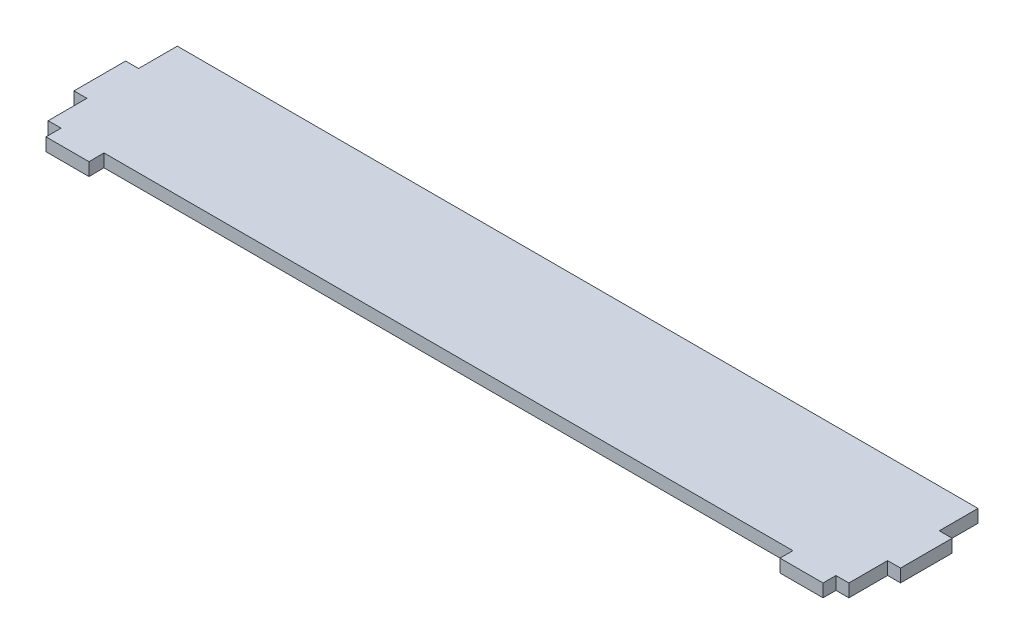
ISO-10303-21;
HEADER;
FILE_DESCRIPTION(('STEP AP214'),'2;1');
FILE_NAME('part.step','',(''),(''),'','','');
FILE_SCHEMA(('AUTOMOTIVE_DESIGN { 1 0 10303 214 1 1 1 1 }'));
ENDSEC;
DATA;
#1=APPLICATION_CONTEXT('core data for automotive mechanical design processes');
#2=APPLICATION_PROTOCOL_DEFINITION('international standard','automotive_design',2000,#1);
#3=PRODUCT_CONTEXT('',#1,'mechanical');
#4=PRODUCT('Part','Part','',(#3));
#5=PRODUCT_RELATED_PRODUCT_CATEGORY('part','',(#4));
#6=PRODUCT_DEFINITION_FORMATION('','',#4);
#7=PRODUCT_DEFINITION_CONTEXT('part definition',#1,'design');
#8=PRODUCT_DEFINITION('design','',#6,#7);
#9=PRODUCT_DEFINITION_SHAPE('','',#8);
#10=(LENGTH_UNIT() NAMED_UNIT(*) SI_UNIT(.MILLI.,.METRE.));
#11=(NAMED_UNIT(*) PLANE_ANGLE_UNIT() SI_UNIT($,.RADIAN.));
#12=(NAMED_UNIT(*) SI_UNIT($,.STERADIAN.) SOLID_ANGLE_UNIT());
#13=UNCERTAINTY_MEASURE_WITH_UNIT(LENGTH_MEASURE(1.E-05),#10,'distance_accuracy_value','');
#14=(GEOMETRIC_REPRESENTATION_CONTEXT(3) GLOBAL_UNCERTAINTY_ASSIGNED_CONTEXT((#13)) GLOBAL_UNIT_ASSIGNED_CONTEXT((#10,
#11,#12)) REPRESENTATION_CONTEXT('',''));
#15=CARTESIAN_POINT('',(0.,0.,0.));
#16=DIRECTION('',(0.,0.,1.));
#17=DIRECTION('',(1.,0.,0.));
#18=AXIS2_PLACEMENT_3D('',#15,#16,#17);
#19=CARTESIAN_POINT('',(0.,3.,-9.));
#20=DIRECTION('',(0.,0.,1.));
#21=DIRECTION('',(1.,0.,0.));
#22=AXIS2_PLACEMENT_3D('',#19,#20,#21);
#23=PLANE('',#22);
#24=DIRECTION('',(-1.,0.,0.));
#25=VECTOR('',#24,1.);
#26=CARTESIAN_POINT('',(0.,0.,-9.));
#27=LINE('',#26,#25);
#28=CARTESIAN_POINT('',(186.,0.,-9.));
#29=VERTEX_POINT('',#28);
#30=CARTESIAN_POINT('',(183.,0.,-9.));
#31=VERTEX_POINT('',#30);
#32=EDGE_CURVE('E211',#29,#31,#27,.T.);
#33=ORIENTED_EDGE('',*,*,#32,.F.);
#34=DIRECTION('',(0.,-1.,0.));
#35=VECTOR('',#34,1.);
#36=CARTESIAN_POINT('',(186.,3.,-9.));
#37=LINE('',#36,#35);
#38=CARTESIAN_POINT('',(186.,3.,-9.));
#39=VERTEX_POINT('',#38);
#40=EDGE_CURVE('E11',#39,#29,#37,.T.);
#41=ORIENTED_EDGE('',*,*,#40,.F.);
#42=DIRECTION('',(-1.,0.,0.));
#43=VECTOR('',#42,1.);
#44=CARTESIAN_POINT('',(0.,3.,-9.));
#45=LINE('',#44,#43);
#46=CARTESIAN_POINT('',(183.,3.,-9.));
#47=VERTEX_POINT('',#46);
#48=EDGE_CURVE('E278',#39,#47,#45,.T.);
#49=ORIENTED_EDGE('',*,*,#48,.T.);
#50=DIRECTION('',(0.,-1.,0.));
#51=VECTOR('',#50,1.);
#52=CARTESIAN_POINT('',(183.,3.,-9.));
#53=LINE('',#52,#51);
#54=EDGE_CURVE('E126',#47,#31,#53,.T.);
#55=ORIENTED_EDGE('',*,*,#54,.T.);
#56=EDGE_LOOP('',(#33,#41,#49,#55));
#57=FACE_BOUND('',#56,.T.);
#58=ADVANCED_FACE('F39',(#57),#23,.T.);
#59=CARTESIAN_POINT('',(186.,3.,0.));
#60=DIRECTION('',(1.,0.,0.));
#61=DIRECTION('',(0.,0.,-1.));
#62=AXIS2_PLACEMENT_3D('',#59,#60,#61);
#63=PLANE('',#62);
#64=DIRECTION('',(0.,0.,1.));
#65=VECTOR('',#64,1.);
#66=CARTESIAN_POINT('',(186.,0.,0.));
#67=LINE('',#66,#65);
#68=CARTESIAN_POINT('',(186.,0.,-21.));
#69=VERTEX_POINT('',#68);
#70=EDGE_CURVE('E215',#69,#29,#67,.T.);
#71=ORIENTED_EDGE('',*,*,#70,.F.);
#72=DIRECTION('',(0.,-1.,0.));
#73=VECTOR('',#72,1.);
#74=CARTESIAN_POINT('',(186.,3.,-21.));
#75=LINE('',#74,#73);
#76=CARTESIAN_POINT('',(186.,3.,-21.));
#77=VERTEX_POINT('',#76);
#78=EDGE_CURVE('E48',#77,#69,#75,.T.);
#79=ORIENTED_EDGE('',*,*,#78,.F.);
#80=DIRECTION('',(0.,0.,1.));
#81=VECTOR('',#80,1.);
#82=CARTESIAN_POINT('',(186.,3.,0.));
#83=LINE('',#82,#81);
#84=EDGE_CURVE('E412',#77,#39,#83,.T.);
#85=ORIENTED_EDGE('',*,*,#84,.T.);
#86=ORIENTED_EDGE('',*,*,#40,.T.);
#87=EDGE_LOOP('',(#71,#79,#85,#86));
#88=FACE_BOUND('',#87,.T.);
#89=ADVANCED_FACE('F345',(#88),#63,.T.);
#90=CARTESIAN_POINT('',(0.,3.,-21.));
#91=DIRECTION('',(0.,0.,-1.));
#92=DIRECTION('',(-1.,0.,0.));
#93=AXIS2_PLACEMENT_3D('',#90,#91,#92);
#94=PLANE('',#93);
#95=DIRECTION('',(1.,0.,0.));
#96=VECTOR('',#95,1.);
#97=CARTESIAN_POINT('',(0.,0.,-21.));
#98=LINE('',#97,#96);
#99=CARTESIAN_POINT('',(183.,0.,-21.));
#100=VERTEX_POINT('',#99);
#101=EDGE_CURVE('E219',#100,#69,#98,.T.);
#102=ORIENTED_EDGE('',*,*,#101,.F.);
#103=DIRECTION('',(0.,-1.,0.));
#104=VECTOR('',#103,1.);
#105=CARTESIAN_POINT('',(183.,3.,-21.));
#106=LINE('',#105,#104);
#107=CARTESIAN_POINT('',(183.,3.,-21.));
#108=VERTEX_POINT('',#107);
#109=EDGE_CURVE('E332',#108,#100,#106,.T.);
#110=ORIENTED_EDGE('',*,*,#109,.F.);
#111=DIRECTION('',(1.,0.,0.));
#112=VECTOR('',#111,1.);
#113=CARTESIAN_POINT('',(0.,3.,-21.));
#114=LINE('',#113,#112);
#115=EDGE_CURVE('E341',#108,#77,#114,.T.);
#116=ORIENTED_EDGE('',*,*,#115,.T.);
#117=ORIENTED_EDGE('',*,*,#78,.T.);
#118=EDGE_LOOP('',(#102,#110,#116,#117));
#119=FACE_BOUND('',#118,.T.);
#120=ADVANCED_FACE('F339',(#119),#94,.T.);
#121=CARTESIAN_POINT('',(183.,3.,0.));
#122=DIRECTION('',(-1.,0.,0.));
#123=DIRECTION('',(0.,0.,1.));
#124=AXIS2_PLACEMENT_3D('',#121,#122,#123);
#125=PLANE('',#124);
#126=DIRECTION('',(0.,0.,-1.));
#127=VECTOR('',#126,1.);
#128=CARTESIAN_POINT('',(183.,0.,0.));
#129=LINE('',#128,#127);
#130=CARTESIAN_POINT('',(183.,0.,-30.));
#131=VERTEX_POINT('',#130);
#132=EDGE_CURVE('E223',#100,#131,#129,.T.);
#133=ORIENTED_EDGE('',*,*,#132,.T.);
#134=DIRECTION('',(0.,-1.,0.));
#135=VECTOR('',#134,1.);
#136=CARTESIAN_POINT('',(183.,3.,-30.));
#137=LINE('',#136,#135);
#138=CARTESIAN_POINT('',(183.,3.,-30.));
#139=VERTEX_POINT('',#138);
#140=EDGE_CURVE('E328',#139,#131,#137,.T.);
#141=ORIENTED_EDGE('',*,*,#140,.F.);
#142=DIRECTION('',(0.,0.,-1.));
#143=VECTOR('',#142,1.);
#144=CARTESIAN_POINT('',(183.,3.,0.));
#145=LINE('',#144,#143);
#146=EDGE_CURVE('E363',#108,#139,#145,.T.);
#147=ORIENTED_EDGE('',*,*,#146,.F.);
#148=ORIENTED_EDGE('',*,*,#109,.T.);
#149=EDGE_LOOP('',(#133,#141,#147,#148));
#150=FACE_BOUND('',#149,.T.);
#151=ADVANCED_FACE('F352',(#150),#125,.F.);
#152=CARTESIAN_POINT('',(0.,3.,-30.));
#153=DIRECTION('',(0.,0.,1.));
#154=DIRECTION('',(1.,0.,0.));
#155=AXIS2_PLACEMENT_3D('',#152,#153,#154);
#156=PLANE('',#155);
#157=DIRECTION('',(-1.,0.,0.));
#158=VECTOR('',#157,1.);
#159=CARTESIAN_POINT('',(0.,0.,-30.));
#160=LINE('',#159,#158);
#161=CARTESIAN_POINT('',(-3.,0.,-30.));
#162=VERTEX_POINT('',#161);
#163=EDGE_CURVE('E226',#131,#162,#160,.T.);
#164=ORIENTED_EDGE('',*,*,#163,.T.);
#165=DIRECTION('',(0.,-1.,0.));
#166=VECTOR('',#165,1.);
#167=CARTESIAN_POINT('',(-3.,3.,-30.));
#168=LINE('',#167,#166);
#169=CARTESIAN_POINT('',(-3.,3.,-30.));
#170=VERTEX_POINT('',#169);
#171=EDGE_CURVE('E325',#170,#162,#168,.T.);
#172=ORIENTED_EDGE('',*,*,#171,.F.);
#173=DIRECTION('',(-1.,0.,0.));
#174=VECTOR('',#173,1.);
#175=CARTESIAN_POINT('',(0.,3.,-30.));
#176=LINE('',#175,#174);
#177=EDGE_CURVE('E358',#139,#170,#176,.T.);
#178=ORIENTED_EDGE('',*,*,#177,.F.);
#179=ORIENTED_EDGE('',*,*,#140,.T.);
#180=EDGE_LOOP('',(#164,#172,#178,#179));
#181=FACE_BOUND('',#180,.T.);
#182=ADVANCED_FACE('F356',(#181),#156,.F.);
#183=CARTESIAN_POINT('',(-3.,3.,0.));
#184=DIRECTION('',(-1.,0.,0.));
#185=DIRECTION('',(0.,0.,1.));
#186=AXIS2_PLACEMENT_3D('',#183,#184,#185);
#187=PLANE('',#186);
#188=DIRECTION('',(0.,0.,-1.));
#189=VECTOR('',#188,1.);
#190=CARTESIAN_POINT('',(-3.,0.,0.));
#191=LINE('',#190,#189);
#192=CARTESIAN_POINT('',(-3.,0.,-21.));
#193=VERTEX_POINT('',#192);
#194=EDGE_CURVE('E230',#193,#162,#191,.T.);
#195=ORIENTED_EDGE('',*,*,#194,.F.);
#196=DIRECTION('',(0.,-1.,0.));
#197=VECTOR('',#196,1.);
#198=CARTESIAN_POINT('',(-3.,3.,-21.));
#199=LINE('',#198,#197);
#200=CARTESIAN_POINT('',(-3.,3.,-21.));
#201=VERTEX_POINT('',#200);
#202=EDGE_CURVE('E322',#201,#193,#199,.T.);
#203=ORIENTED_EDGE('',*,*,#202,.F.);
#204=DIRECTION('',(0.,0.,-1.));
#205=VECTOR('',#204,1.);
#206=CARTESIAN_POINT('',(-3.,3.,0.));
#207=LINE('',#206,#205);
#208=EDGE_CURVE('E362',#201,#170,#207,.T.);
#209=ORIENTED_EDGE('',*,*,#208,.T.);
#210=ORIENTED_EDGE('',*,*,#171,.T.);
#211=EDGE_LOOP('',(#195,#203,#209,#210));
#212=FACE_BOUND('',#211,.T.);
#213=ADVANCED_FACE('F430',(#212),#187,.T.);
#214=CARTESIAN_POINT('',(0.,3.,-21.));
#215=DIRECTION('',(0.,0.,1.));
#216=DIRECTION('',(1.,0.,0.));
#217=AXIS2_PLACEMENT_3D('',#214,#215,#216);
#218=PLANE('',#217);
#219=DIRECTION('',(-1.,0.,0.));
#220=VECTOR('',#219,1.);
#221=CARTESIAN_POINT('',(0.,0.,-21.));
#222=LINE('',#221,#220);
#223=CARTESIAN_POINT('',(-6.,0.,-21.));
#224=VERTEX_POINT('',#223);
#225=EDGE_CURVE('E234',#193,#224,#222,.T.);
#226=ORIENTED_EDGE('',*,*,#225,.T.);
#227=DIRECTION('',(0.,-1.,0.));
#228=VECTOR('',#227,1.);
#229=CARTESIAN_POINT('',(-6.,3.,-21.));
#230=LINE('',#229,#228);
#231=CARTESIAN_POINT('',(-6.,3.,-21.));
#232=VERTEX_POINT('',#231);
#233=EDGE_CURVE('E318',#232,#224,#230,.T.);
#234=ORIENTED_EDGE('',*,*,#233,.F.);
#235=DIRECTION('',(-1.,0.,0.));
#236=VECTOR('',#235,1.);
#237=CARTESIAN_POINT('',(0.,3.,-21.));
#238=LINE('',#237,#236);
#239=EDGE_CURVE('E367',#201,#232,#238,.T.);
#240=ORIENTED_EDGE('',*,*,#239,.F.);
#241=ORIENTED_EDGE('',*,*,#202,.T.);
#242=EDGE_LOOP('',(#226,#234,#240,#241));
#243=FACE_BOUND('',#242,.T.);
#244=ADVANCED_FACE('F433',(#243),#218,.F.);
#245=CARTESIAN_POINT('',(-6.,3.,0.));
#246=DIRECTION('',(1.,0.,0.));
#247=DIRECTION('',(0.,0.,-1.));
#248=AXIS2_PLACEMENT_3D('',#245,#246,#247);
#249=PLANE('',#248);
#250=DIRECTION('',(0.,0.,1.));
#251=VECTOR('',#250,1.);
#252=CARTESIAN_POINT('',(-6.,0.,0.));
#253=LINE('',#252,#251);
#254=CARTESIAN_POINT('',(-6.,0.,-9.));
#255=VERTEX_POINT('',#254);
#256=EDGE_CURVE('E237',#224,#255,#253,.T.);
#257=ORIENTED_EDGE('',*,*,#256,.T.);
#258=DIRECTION('',(0.,-1.,0.));
#259=VECTOR('',#258,1.);
#260=CARTESIAN_POINT('',(-6.,3.,-9.));
#261=LINE('',#260,#259);
#262=CARTESIAN_POINT('',(-6.,3.,-9.));
#263=VERTEX_POINT('',#262);
#264=EDGE_CURVE('E314',#263,#255,#261,.T.);
#265=ORIENTED_EDGE('',*,*,#264,.F.);
#266=DIRECTION('',(0.,0.,1.));
#267=VECTOR('',#266,1.);
#268=CARTESIAN_POINT('',(-6.,3.,0.));
#269=LINE('',#268,#267);
#270=EDGE_CURVE('E374',#232,#263,#269,.T.);
#271=ORIENTED_EDGE('',*,*,#270,.F.);
#272=ORIENTED_EDGE('',*,*,#233,.T.);
#273=EDGE_LOOP('',(#257,#265,#271,#272));
#274=FACE_BOUND('',#273,.T.);
#275=ADVANCED_FACE('F437',(#274),#249,.F.);
#276=CARTESIAN_POINT('',(0.,3.,-9.));
#277=DIRECTION('',(0.,0.,-1.));
#278=DIRECTION('',(-1.,0.,0.));
#279=AXIS2_PLACEMENT_3D('',#276,#277,#278);
#280=PLANE('',#279);
#281=DIRECTION('',(1.,0.,0.));
#282=VECTOR('',#281,1.);
#283=CARTESIAN_POINT('',(0.,0.,-9.));
#284=LINE('',#283,#282);
#285=CARTESIAN_POINT('',(-3.,0.,-9.));
#286=VERTEX_POINT('',#285);
#287=EDGE_CURVE('E240',#255,#286,#284,.T.);
#288=ORIENTED_EDGE('',*,*,#287,.T.);
#289=DIRECTION('',(0.,-1.,0.));
#290=VECTOR('',#289,1.);
#291=CARTESIAN_POINT('',(-3.,3.,-9.));
#292=LINE('',#291,#290);
#293=CARTESIAN_POINT('',(-3.,3.,-9.));
#294=VERTEX_POINT('',#293);
#295=EDGE_CURVE('E310',#294,#286,#292,.T.);
#296=ORIENTED_EDGE('',*,*,#295,.F.);
#297=DIRECTION('',(1.,0.,0.));
#298=VECTOR('',#297,1.);
#299=CARTESIAN_POINT('',(0.,3.,-9.));
#300=LINE('',#299,#298);
#301=EDGE_CURVE('E377',#263,#294,#300,.T.);
#302=ORIENTED_EDGE('',*,*,#301,.F.);
#303=ORIENTED_EDGE('',*,*,#264,.T.);
#304=EDGE_LOOP('',(#288,#296,#302,#303));
#305=FACE_BOUND('',#304,.T.);
#306=ADVANCED_FACE('F441',(#305),#280,.F.);
#307=CARTESIAN_POINT('',(-3.,3.,0.));
#308=DIRECTION('',(1.,0.,0.));
#309=DIRECTION('',(0.,0.,-1.));
#310=AXIS2_PLACEMENT_3D('',#307,#308,#309);
#311=PLANE('',#310);
#312=DIRECTION('',(0.,0.,1.));
#313=VECTOR('',#312,1.);
#314=CARTESIAN_POINT('',(-3.,0.,0.));
#315=LINE('',#314,#313);
#316=CARTESIAN_POINT('',(-3.,0.,0.));
#317=VERTEX_POINT('',#316);
#318=EDGE_CURVE('E243',#286,#317,#315,.T.);
#319=ORIENTED_EDGE('',*,*,#318,.T.);
#320=DIRECTION('',(0.,-1.,0.));
#321=VECTOR('',#320,1.);
#322=CARTESIAN_POINT('',(-3.,3.,0.));
#323=LINE('',#322,#321);
#324=CARTESIAN_POINT('',(-3.,3.,0.));
#325=VERTEX_POINT('',#324);
#326=EDGE_CURVE('E306',#325,#317,#323,.T.);
#327=ORIENTED_EDGE('',*,*,#326,.F.);
#328=DIRECTION('',(0.,0.,1.));
#329=VECTOR('',#328,1.);
#330=CARTESIAN_POINT('',(-3.,3.,0.));
#331=LINE('',#330,#329);
#332=EDGE_CURVE('E380',#294,#325,#331,.T.);
#333=ORIENTED_EDGE('',*,*,#332,.F.);
#334=ORIENTED_EDGE('',*,*,#295,.T.);
#335=EDGE_LOOP('',(#319,#327,#333,#334));
#336=FACE_BOUND('',#335,.T.);
#337=ADVANCED_FACE('F445',(#336),#311,.F.);
#338=CARTESIAN_POINT('',(0.,3.,0.));
#339=DIRECTION('',(0.,0.,-1.));
#340=DIRECTION('',(-1.,0.,0.));
#341=AXIS2_PLACEMENT_3D('',#338,#339,#340);
#342=PLANE('',#341);
#343=DIRECTION('',(1.,0.,0.));
#344=VECTOR('',#343,1.);
#345=CARTESIAN_POINT('',(0.,0.,0.));
#346=LINE('',#345,#344);
#347=CARTESIAN_POINT('',(0.,0.,0.));
#348=VERTEX_POINT('',#347);
#349=EDGE_CURVE('E246',#317,#348,#346,.T.);
#350=ORIENTED_EDGE('',*,*,#349,.T.);
#351=DIRECTION('',(0.,-1.,0.));
#352=VECTOR('',#351,1.);
#353=CARTESIAN_POINT('',(0.,3.,0.));
#354=LINE('',#353,#352);
#355=CARTESIAN_POINT('',(0.,3.,0.));
#356=VERTEX_POINT('',#355);
#357=EDGE_CURVE('E302',#356,#348,#354,.T.);
#358=ORIENTED_EDGE('',*,*,#357,.F.);
#359=DIRECTION('',(1.,0.,0.));
#360=VECTOR('',#359,1.);
#361=CARTESIAN_POINT('',(0.,3.,0.));
#362=LINE('',#361,#360);
#363=EDGE_CURVE('E383',#325,#356,#362,.T.);
#364=ORIENTED_EDGE('',*,*,#363,.F.);
#365=ORIENTED_EDGE('',*,*,#326,.T.);
#366=EDGE_LOOP('',(#350,#358,#364,#365));
#367=FACE_BOUND('',#366,.T.);
#368=ADVANCED_FACE('F449',(#367),#342,.F.);
#369=CARTESIAN_POINT('',(0.,3.,0.));
#370=DIRECTION('',(1.,0.,0.));
#371=DIRECTION('',(0.,0.,-1.));
#372=AXIS2_PLACEMENT_3D('',#369,#370,#371);
#373=PLANE('',#372);
#374=DIRECTION('',(0.,0.,1.));
#375=VECTOR('',#374,1.);
#376=CARTESIAN_POINT('',(0.,0.,0.));
#377=LINE('',#376,#375);
#378=CARTESIAN_POINT('',(0.,0.,3.50479653710962));
#379=VERTEX_POINT('',#378);
#380=EDGE_CURVE('E249',#348,#379,#377,.T.);
#381=ORIENTED_EDGE('',*,*,#380,.T.);
#382=DIRECTION('',(0.,-1.,0.));
#383=VECTOR('',#382,1.);
#384=CARTESIAN_POINT('',(0.,3.,3.50479653710962));
#385=LINE('',#384,#383);
#386=CARTESIAN_POINT('',(0.,3.,3.50479653710962));
#387=VERTEX_POINT('',#386);
#388=EDGE_CURVE('E298',#387,#379,#385,.T.);
#389=ORIENTED_EDGE('',*,*,#388,.F.);
#390=DIRECTION('',(0.,0.,1.));
#391=VECTOR('',#390,1.);
#392=CARTESIAN_POINT('',(0.,3.,0.));
#393=LINE('',#392,#391);
#394=EDGE_CURVE('E386',#356,#387,#393,.T.);
#395=ORIENTED_EDGE('',*,*,#394,.F.);
#396=ORIENTED_EDGE('',*,*,#357,.T.);
#397=EDGE_LOOP('',(#381,#389,#395,#396));
#398=FACE_BOUND('',#397,.T.);
#399=ADVANCED_FACE('F453',(#398),#373,.F.);
#400=CARTESIAN_POINT('',(0.,3.,3.50479653710962));
#401=DIRECTION('',(0.,0.,-1.));
#402=DIRECTION('',(-1.,0.,0.));
#403=AXIS2_PLACEMENT_3D('',#400,#401,#402);
#404=PLANE('',#403);
#405=DIRECTION('',(1.,0.,0.));
#406=VECTOR('',#405,1.);
#407=CARTESIAN_POINT('',(0.,0.,3.50479653710962));
#408=LINE('',#407,#406);
#409=CARTESIAN_POINT('',(10.,0.,3.50479653710962));
#410=VERTEX_POINT('',#409);
#411=EDGE_CURVE('E252',#379,#410,#408,.T.);
#412=ORIENTED_EDGE('',*,*,#411,.T.);
#413=DIRECTION('',(0.,-1.,0.));
#414=VECTOR('',#413,1.);
#415=CARTESIAN_POINT('',(10.,3.,3.50479653710962));
#416=LINE('',#415,#414);
#417=CARTESIAN_POINT('',(10.,3.,3.50479653710962));
#418=VERTEX_POINT('',#417);
#419=EDGE_CURVE('E294',#418,#410,#416,.T.);
#420=ORIENTED_EDGE('',*,*,#419,.F.);
#421=DIRECTION('',(1.,0.,0.));
#422=VECTOR('',#421,1.);
#423=CARTESIAN_POINT('',(0.,3.,3.50479653710962));
#424=LINE('',#423,#422);
#425=EDGE_CURVE('E389',#387,#418,#424,.T.);
#426=ORIENTED_EDGE('',*,*,#425,.F.);
#427=ORIENTED_EDGE('',*,*,#388,.T.);
#428=EDGE_LOOP('',(#412,#420,#426,#427));
#429=FACE_BOUND('',#428,.T.);
#430=ADVANCED_FACE('F457',(#429),#404,.F.);
#431=CARTESIAN_POINT('',(9.94797535405886,3.,-0.141919441666993));
#432=DIRECTION('',(-0.999898253821791,0.,0.0142647118489585));
#433=DIRECTION('',(0.0142647118489585,0.,0.999898253821791));
#434=AXIS2_PLACEMENT_3D('',#431,#432,#433);
#435=PLANE('',#434);
#436=DIRECTION('',(-0.0142647118489585,0.,-0.999898253821791));
#437=VECTOR('',#436,1.);
#438=CARTESIAN_POINT('',(9.94797535405886,0.,-0.141919441666993));
#439=LINE('',#438,#437);
#440=CARTESIAN_POINT('',(9.94999999999999,0.,0.));
#441=VERTEX_POINT('',#440);
#442=EDGE_CURVE('E255',#410,#441,#439,.T.);
#443=ORIENTED_EDGE('',*,*,#442,.T.);
#444=DIRECTION('',(0.,-1.,0.));
#445=VECTOR('',#444,1.);
#446=CARTESIAN_POINT('',(9.94999999999999,3.,0.));
#447=LINE('',#446,#445);
#448=CARTESIAN_POINT('',(9.94999999999999,3.,0.));
#449=VERTEX_POINT('',#448);
#450=EDGE_CURVE('E291',#449,#441,#447,.T.);
#451=ORIENTED_EDGE('',*,*,#450,.F.);
#452=DIRECTION('',(-0.0142647118489585,0.,-0.999898253821791));
#453=VECTOR('',#452,1.);
#454=CARTESIAN_POINT('',(9.94797535405886,3.,-0.141919441666993));
#455=LINE('',#454,#453);
#456=EDGE_CURVE('E392',#418,#449,#455,.T.);
#457=ORIENTED_EDGE('',*,*,#456,.F.);
#458=ORIENTED_EDGE('',*,*,#419,.T.);
#459=EDGE_LOOP('',(#443,#451,#457,#458));
#460=FACE_BOUND('',#459,.T.);
#461=ADVANCED_FACE('F461',(#460),#435,.F.);
#462=CARTESIAN_POINT('',(0.,3.,0.));
#463=DIRECTION('',(0.,0.,1.));
#464=DIRECTION('',(1.,0.,0.));
#465=AXIS2_PLACEMENT_3D('',#462,#463,#464);
#466=PLANE('',#465);
#467=DIRECTION('',(-1.,0.,0.));
#468=VECTOR('',#467,1.);
#469=CARTESIAN_POINT('',(0.,0.,0.));
#470=LINE('',#469,#468);
#471=CARTESIAN_POINT('',(170.,0.,0.));
#472=VERTEX_POINT('',#471);
#473=EDGE_CURVE('E259',#472,#441,#470,.T.);
#474=ORIENTED_EDGE('',*,*,#473,.F.);
#475=DIRECTION('',(0.,-1.,0.));
#476=VECTOR('',#475,1.);
#477=CARTESIAN_POINT('',(170.,3.,0.));
#478=LINE('',#477,#476);
#479=CARTESIAN_POINT('',(170.,3.,0.));
#480=VERTEX_POINT('',#479);
#481=EDGE_CURVE('E288',#480,#472,#478,.T.);
#482=ORIENTED_EDGE('',*,*,#481,.F.);
#483=DIRECTION('',(-1.,0.,0.));
#484=VECTOR('',#483,1.);
#485=CARTESIAN_POINT('',(0.,3.,0.));
#486=LINE('',#485,#484);
#487=EDGE_CURVE('E395',#480,#449,#486,.T.);
#488=ORIENTED_EDGE('',*,*,#487,.T.);
#489=ORIENTED_EDGE('',*,*,#450,.T.);
#490=EDGE_LOOP('',(#474,#482,#488,#489));
#491=FACE_BOUND('',#490,.T.);
#492=ADVANCED_FACE('F465',(#491),#466,.T.);
#493=CARTESIAN_POINT('',(170.,3.,0.));
#494=DIRECTION('',(-1.,0.,0.));
#495=DIRECTION('',(0.,0.,1.));
#496=AXIS2_PLACEMENT_3D('',#493,#494,#495);
#497=PLANE('',#496);
#498=DIRECTION('',(0.,0.,-1.));
#499=VECTOR('',#498,1.);
#500=CARTESIAN_POINT('',(170.,0.,0.));
#501=LINE('',#500,#499);
#502=CARTESIAN_POINT('',(170.,0.,3.));
#503=VERTEX_POINT('',#502);
#504=EDGE_CURVE('E263',#503,#472,#501,.T.);
#505=ORIENTED_EDGE('',*,*,#504,.F.);
#506=DIRECTION('',(0.,-1.,0.));
#507=VECTOR('',#506,1.);
#508=CARTESIAN_POINT('',(170.,3.,3.));
#509=LINE('',#508,#507);
#510=CARTESIAN_POINT('',(170.,3.,3.));
#511=VERTEX_POINT('',#510);
#512=EDGE_CURVE('E285',#511,#503,#509,.T.);
#513=ORIENTED_EDGE('',*,*,#512,.F.);
#514=DIRECTION('',(0.,0.,-1.));
#515=VECTOR('',#514,1.);
#516=CARTESIAN_POINT('',(170.,3.,0.));
#517=LINE('',#516,#515);
#518=EDGE_CURVE('E205',#511,#480,#517,.T.);
#519=ORIENTED_EDGE('',*,*,#518,.T.);
#520=ORIENTED_EDGE('',*,*,#481,.T.);
#521=EDGE_LOOP('',(#505,#513,#519,#520));
#522=FACE_BOUND('',#521,.T.);
#523=ADVANCED_FACE('F402',(#522),#497,.T.);
#524=CARTESIAN_POINT('',(0.,3.,3.));
#525=DIRECTION('',(0.,0.,1.));
#526=DIRECTION('',(1.,0.,0.));
#527=AXIS2_PLACEMENT_3D('',#524,#525,#526);
#528=PLANE('',#527);
#529=DIRECTION('',(-1.,0.,0.));
#530=VECTOR('',#529,1.);
#531=CARTESIAN_POINT('',(0.,0.,3.));
#532=LINE('',#531,#530);
#533=CARTESIAN_POINT('',(180.,0.,3.));
#534=VERTEX_POINT('',#533);
#535=EDGE_CURVE('E267',#534,#503,#532,.T.);
#536=ORIENTED_EDGE('',*,*,#535,.F.);
#537=DIRECTION('',(0.,-1.,0.));
#538=VECTOR('',#537,1.);
#539=CARTESIAN_POINT('',(180.,3.,3.));
#540=LINE('',#539,#538);
#541=CARTESIAN_POINT('',(180.,3.,3.));
#542=VERTEX_POINT('',#541);
#543=EDGE_CURVE('E190',#542,#534,#540,.T.);
#544=ORIENTED_EDGE('',*,*,#543,.F.);
#545=DIRECTION('',(-1.,0.,0.));
#546=VECTOR('',#545,1.);
#547=CARTESIAN_POINT('',(0.,3.,3.));
#548=LINE('',#547,#546);
#549=EDGE_CURVE('E201',#542,#511,#548,.T.);
#550=ORIENTED_EDGE('',*,*,#549,.T.);
#551=ORIENTED_EDGE('',*,*,#512,.T.);
#552=EDGE_LOOP('',(#536,#544,#550,#551));
#553=FACE_BOUND('',#552,.T.);
#554=ADVANCED_FACE('F407',(#553),#528,.T.);
#555=CARTESIAN_POINT('',(180.,3.,0.));
#556=DIRECTION('',(1.,0.,0.));
#557=DIRECTION('',(0.,0.,-1.));
#558=AXIS2_PLACEMENT_3D('',#555,#556,#557);
#559=PLANE('',#558);
#560=DIRECTION('',(0.,0.,1.));
#561=VECTOR('',#560,1.);
#562=CARTESIAN_POINT('',(180.,0.,0.));
#563=LINE('',#562,#561);
#564=CARTESIAN_POINT('',(180.,0.,0.));
#565=VERTEX_POINT('',#564);
#566=EDGE_CURVE('E188',#565,#534,#563,.T.);
#567=ORIENTED_EDGE('',*,*,#566,.F.);
#568=DIRECTION('',(0.,-1.,0.));
#569=VECTOR('',#568,1.);
#570=CARTESIAN_POINT('',(180.,3.,0.));
#571=LINE('',#570,#569);
#572=CARTESIAN_POINT('',(180.,3.,0.));
#573=VERTEX_POINT('',#572);
#574=EDGE_CURVE('E182',#573,#565,#571,.T.);
#575=ORIENTED_EDGE('',*,*,#574,.F.);
#576=DIRECTION('',(0.,0.,1.));
#577=VECTOR('',#576,1.);
#578=CARTESIAN_POINT('',(180.,3.,0.));
#579=LINE('',#578,#577);
#580=EDGE_CURVE('E186',#573,#542,#579,.T.);
#581=ORIENTED_EDGE('',*,*,#580,.T.);
#582=ORIENTED_EDGE('',*,*,#543,.T.);
#583=EDGE_LOOP('',(#567,#575,#581,#582));
#584=FACE_BOUND('',#583,.T.);
#585=ADVANCED_FACE('F184',(#584),#559,.T.);
#586=CARTESIAN_POINT('',(0.,3.,0.));
#587=DIRECTION('',(0.,0.,-1.));
#588=DIRECTION('',(-1.,0.,0.));
#589=AXIS2_PLACEMENT_3D('',#586,#587,#588);
#590=PLANE('',#589);
#591=DIRECTION('',(1.,0.,0.));
#592=VECTOR('',#591,1.);
#593=CARTESIAN_POINT('',(0.,0.,0.));
#594=LINE('',#593,#592);
#595=CARTESIAN_POINT('',(183.,0.,0.));
#596=VERTEX_POINT('',#595);
#597=EDGE_CURVE('E119',#565,#596,#594,.T.);
#598=ORIENTED_EDGE('',*,*,#597,.T.);
#599=DIRECTION('',(0.,-1.,0.));
#600=VECTOR('',#599,1.);
#601=CARTESIAN_POINT('',(183.,3.,0.));
#602=LINE('',#601,#600);
#603=CARTESIAN_POINT('',(183.,3.,0.));
#604=VERTEX_POINT('',#603);
#605=EDGE_CURVE('E191',#604,#596,#602,.T.);
#606=ORIENTED_EDGE('',*,*,#605,.F.);
#607=DIRECTION('',(1.,0.,0.));
#608=VECTOR('',#607,1.);
#609=CARTESIAN_POINT('',(0.,3.,0.));
#610=LINE('',#609,#608);
#611=EDGE_CURVE('E193',#573,#604,#610,.T.);
#612=ORIENTED_EDGE('',*,*,#611,.F.);
#613=ORIENTED_EDGE('',*,*,#574,.T.);
#614=EDGE_LOOP('',(#598,#606,#612,#613));
#615=FACE_BOUND('',#614,.T.);
#616=ADVANCED_FACE('F194',(#615),#590,.F.);
#617=CARTESIAN_POINT('',(183.,3.,0.));
#618=DIRECTION('',(-1.,0.,0.));
#619=DIRECTION('',(0.,0.,1.));
#620=AXIS2_PLACEMENT_3D('',#617,#618,#619);
#621=PLANE('',#620);
#622=DIRECTION('',(0.,0.,-1.));
#623=VECTOR('',#622,1.);
#624=CARTESIAN_POINT('',(183.,0.,0.));
#625=LINE('',#624,#623);
#626=EDGE_CURVE('E275',#596,#31,#625,.T.);
#627=ORIENTED_EDGE('',*,*,#626,.T.);
#628=ORIENTED_EDGE('',*,*,#54,.F.);
#629=DIRECTION('',(0.,0.,-1.));
#630=VECTOR('',#629,1.);
#631=CARTESIAN_POINT('',(183.,3.,0.));
#632=LINE('',#631,#630);
#633=EDGE_CURVE('E56',#604,#47,#632,.T.);
#634=ORIENTED_EDGE('',*,*,#633,.F.);
#635=ORIENTED_EDGE('',*,*,#605,.T.);
#636=EDGE_LOOP('',(#627,#628,#634,#635));
#637=FACE_BOUND('',#636,.T.);
#638=ADVANCED_FACE('F410',(#637),#621,.F.);
#639=CARTESIAN_POINT('',(0.,3.,0.));
#640=DIRECTION('',(0.,1.,0.));
#641=DIRECTION('',(0.,0.,1.));
#642=AXIS2_PLACEMENT_3D('',#639,#640,#641);
#643=PLANE('',#642);
#644=ORIENTED_EDGE('',*,*,#48,.F.);
#645=ORIENTED_EDGE('',*,*,#84,.F.);
#646=ORIENTED_EDGE('',*,*,#115,.F.);
#647=ORIENTED_EDGE('',*,*,#146,.T.);
#648=ORIENTED_EDGE('',*,*,#177,.T.);
#649=ORIENTED_EDGE('',*,*,#208,.F.);
#650=ORIENTED_EDGE('',*,*,#239,.T.);
#651=ORIENTED_EDGE('',*,*,#270,.T.);
#652=ORIENTED_EDGE('',*,*,#301,.T.);
#653=ORIENTED_EDGE('',*,*,#332,.T.);
#654=ORIENTED_EDGE('',*,*,#363,.T.);
#655=ORIENTED_EDGE('',*,*,#394,.T.);
#656=ORIENTED_EDGE('',*,*,#425,.T.);
#657=ORIENTED_EDGE('',*,*,#456,.T.);
#658=ORIENTED_EDGE('',*,*,#487,.F.);
#659=ORIENTED_EDGE('',*,*,#518,.F.);
#660=ORIENTED_EDGE('',*,*,#549,.F.);
#661=ORIENTED_EDGE('',*,*,#580,.F.);
#662=ORIENTED_EDGE('',*,*,#611,.T.);
#663=ORIENTED_EDGE('',*,*,#633,.T.);
#664=EDGE_LOOP('',(#644,#645,#646,#647,#648,#649,#650,#651,#652,#653,#654,#655,#656,#657,#658,
#659,#660,#661,#662,#663));
#665=FACE_BOUND('',#664,.T.);
#666=ADVANCED_FACE('F198',(#665),#643,.T.);
#667=CARTESIAN_POINT('',(0.,0.,0.));
#668=DIRECTION('',(0.,1.,0.));
#669=DIRECTION('',(0.,0.,1.));
#670=AXIS2_PLACEMENT_3D('',#667,#668,#669);
#671=PLANE('',#670);
#672=ORIENTED_EDGE('',*,*,#32,.T.);
#673=ORIENTED_EDGE('',*,*,#626,.F.);
#674=ORIENTED_EDGE('',*,*,#597,.F.);
#675=ORIENTED_EDGE('',*,*,#566,.T.);
#676=ORIENTED_EDGE('',*,*,#535,.T.);
#677=ORIENTED_EDGE('',*,*,#504,.T.);
#678=ORIENTED_EDGE('',*,*,#473,.T.);
#679=ORIENTED_EDGE('',*,*,#442,.F.);
#680=ORIENTED_EDGE('',*,*,#411,.F.);
#681=ORIENTED_EDGE('',*,*,#380,.F.);
#682=ORIENTED_EDGE('',*,*,#349,.F.);
#683=ORIENTED_EDGE('',*,*,#318,.F.);
#684=ORIENTED_EDGE('',*,*,#287,.F.);
#685=ORIENTED_EDGE('',*,*,#256,.F.);
#686=ORIENTED_EDGE('',*,*,#225,.F.);
#687=ORIENTED_EDGE('',*,*,#194,.T.);
#688=ORIENTED_EDGE('',*,*,#163,.F.);
#689=ORIENTED_EDGE('',*,*,#132,.F.);
#690=ORIENTED_EDGE('',*,*,#101,.T.);
#691=ORIENTED_EDGE('',*,*,#70,.T.);
#692=EDGE_LOOP('',(#672,#673,#674,#675,#676,#677,#678,#679,#680,#681,#682,#683,#684,#685,#686,
#687,#688,#689,#690,#691));
#693=FACE_BOUND('',#692,.T.);
#694=ADVANCED_FACE('F348',(#693),#671,.F.);
#695=CLOSED_SHELL('',(#58,#89,#120,#151,#182,#213,#244,#275,#306,#337,#368,#399,#430,#461,#492,
#523,#554,#585,#616,#638,#666,#694));
#696=MANIFOLD_SOLID_BREP('B2',#695);
#697=ADVANCED_BREP_SHAPE_REPRESENTATION('',(#18,#696),#14);
#698=SHAPE_DEFINITION_REPRESENTATION(#9,#697);
ENDSEC;
END-ISO-10303-21;
